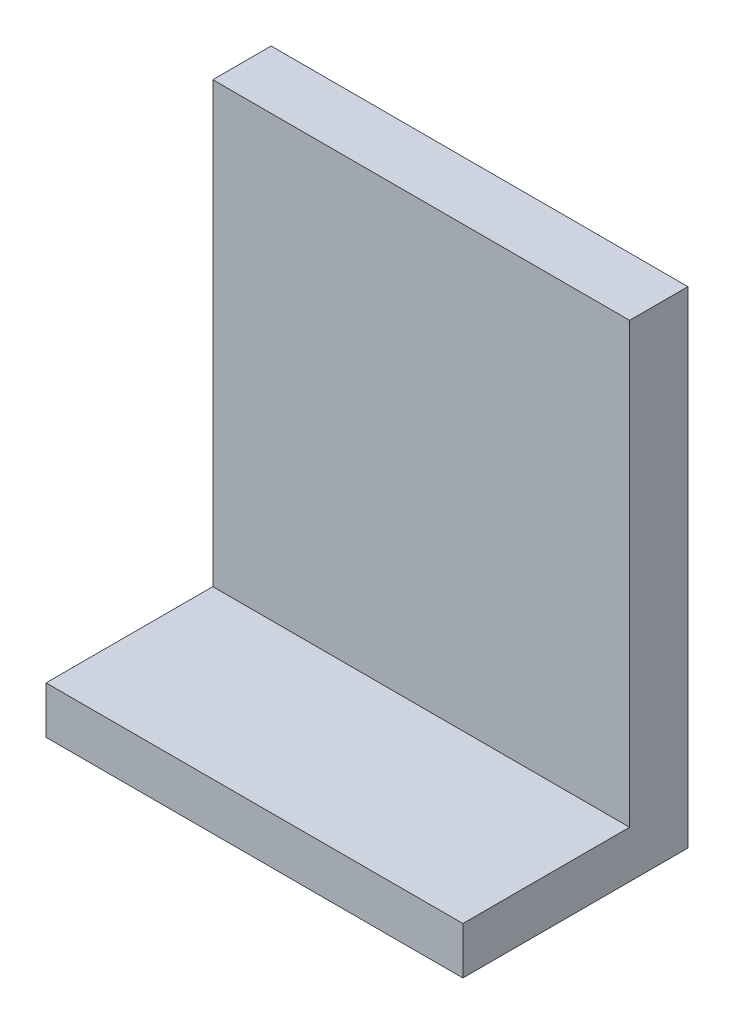
ISO-10303-21;
HEADER;
FILE_DESCRIPTION(('STEP AP214'),'2;1');
FILE_NAME('part.step','',(''),(''),'','','');
FILE_SCHEMA(('AUTOMOTIVE_DESIGN { 1 0 10303 214 1 1 1 1 }'));
ENDSEC;
DATA;
#1=APPLICATION_CONTEXT('core data for automotive mechanical design processes');
#2=APPLICATION_PROTOCOL_DEFINITION('international standard','automotive_design',2000,#1);
#3=PRODUCT_CONTEXT('',#1,'mechanical');
#4=PRODUCT('Part','Part','',(#3));
#5=PRODUCT_RELATED_PRODUCT_CATEGORY('part','',(#4));
#6=PRODUCT_DEFINITION_FORMATION('','',#4);
#7=PRODUCT_DEFINITION_CONTEXT('part definition',#1,'design');
#8=PRODUCT_DEFINITION('design','',#6,#7);
#9=PRODUCT_DEFINITION_SHAPE('','',#8);
#10=(LENGTH_UNIT() NAMED_UNIT(*) SI_UNIT(.MILLI.,.METRE.));
#11=(NAMED_UNIT(*) PLANE_ANGLE_UNIT() SI_UNIT($,.RADIAN.));
#12=(NAMED_UNIT(*) SI_UNIT($,.STERADIAN.) SOLID_ANGLE_UNIT());
#13=UNCERTAINTY_MEASURE_WITH_UNIT(LENGTH_MEASURE(1.E-05),#10,'distance_accuracy_value','');
#14=(GEOMETRIC_REPRESENTATION_CONTEXT(3) GLOBAL_UNCERTAINTY_ASSIGNED_CONTEXT((#13)) GLOBAL_UNIT_ASSIGNED_CONTEXT((#10,
#11,#12)) REPRESENTATION_CONTEXT('',''));
#15=CARTESIAN_POINT('',(0.,0.,0.));
#16=DIRECTION('',(0.,0.,1.));
#17=DIRECTION('',(1.,0.,0.));
#18=AXIS2_PLACEMENT_3D('',#15,#16,#17);
#19=CARTESIAN_POINT('',(0.,0.,7.));
#20=DIRECTION('',(1.,0.,0.));
#21=DIRECTION('',(0.,0.,-1.));
#22=AXIS2_PLACEMENT_3D('',#19,#20,#21);
#23=PLANE('',#22);
#24=DIRECTION('',(0.,-1.,0.));
#25=VECTOR('',#24,1.);
#26=CARTESIAN_POINT('',(0.,0.,0.));
#27=LINE('',#26,#25);
#28=CARTESIAN_POINT('',(0.,0.,0.));
#29=VERTEX_POINT('',#28);
#30=CARTESIAN_POINT('',(0.,-58.3196046128501,0.));
#31=VERTEX_POINT('',#30);
#32=EDGE_CURVE('E92',#29,#31,#27,.T.);
#33=ORIENTED_EDGE('',*,*,#32,.T.);
#34=DIRECTION('',(0.,0.,-1.));
#35=VECTOR('',#34,1.);
#36=CARTESIAN_POINT('',(0.,-58.3196046128501,7.));
#37=LINE('',#36,#35);
#38=CARTESIAN_POINT('',(0.,-58.3196046128501,27.));
#39=VERTEX_POINT('',#38);
#40=EDGE_CURVE('E11',#39,#31,#37,.T.);
#41=ORIENTED_EDGE('',*,*,#40,.F.);
#42=DIRECTION('',(0.,-1.,0.));
#43=VECTOR('',#42,1.);
#44=CARTESIAN_POINT('',(0.,-52.6611613799538,27.));
#45=LINE('',#44,#43);
#46=CARTESIAN_POINT('',(0.,-52.6611613799538,27.));
#47=VERTEX_POINT('',#46);
#48=EDGE_CURVE('E129',#47,#39,#45,.T.);
#49=ORIENTED_EDGE('',*,*,#48,.F.);
#50=DIRECTION('',(0.,0.,-1.));
#51=VECTOR('',#50,1.);
#52=CARTESIAN_POINT('',(0.,-52.6611613799538,27.));
#53=LINE('',#52,#51);
#54=CARTESIAN_POINT('',(0.,-52.6611613799538,7.));
#55=VERTEX_POINT('',#54);
#56=EDGE_CURVE('E101',#47,#55,#53,.T.);
#57=ORIENTED_EDGE('',*,*,#56,.T.);
#58=DIRECTION('',(0.,-1.,0.));
#59=VECTOR('',#58,1.);
#60=CARTESIAN_POINT('',(0.,0.,7.));
#61=LINE('',#60,#59);
#62=CARTESIAN_POINT('',(0.,0.,7.));
#63=VERTEX_POINT('',#62);
#64=EDGE_CURVE('E86',#63,#55,#61,.T.);
#65=ORIENTED_EDGE('',*,*,#64,.F.);
#66=DIRECTION('',(0.,0.,-1.));
#67=VECTOR('',#66,1.);
#68=CARTESIAN_POINT('',(0.,0.,7.));
#69=LINE('',#68,#67);
#70=EDGE_CURVE('E79',#63,#29,#69,.T.);
#71=ORIENTED_EDGE('',*,*,#70,.T.);
#72=EDGE_LOOP('',(#33,#41,#49,#57,#65,#71));
#73=FACE_BOUND('',#72,.T.);
#74=ADVANCED_FACE('F37',(#73),#23,.F.);
#75=CARTESIAN_POINT('',(0.,-58.3196046128501,7.));
#76=DIRECTION('',(0.,1.,0.));
#77=DIRECTION('',(0.,0.,1.));
#78=AXIS2_PLACEMENT_3D('',#75,#76,#77);
#79=PLANE('',#78);
#80=DIRECTION('',(1.,0.,0.));
#81=VECTOR('',#80,1.);
#82=CARTESIAN_POINT('',(0.,-58.3196046128501,0.));
#83=LINE('',#82,#81);
#84=CARTESIAN_POINT('',(50.,-58.3196046128501,0.));
#85=VERTEX_POINT('',#84);
#86=EDGE_CURVE('E96',#31,#85,#83,.T.);
#87=ORIENTED_EDGE('',*,*,#86,.T.);
#88=DIRECTION('',(0.,0.,-1.));
#89=VECTOR('',#88,1.);
#90=CARTESIAN_POINT('',(50.,-58.3196046128501,7.));
#91=LINE('',#90,#89);
#92=CARTESIAN_POINT('',(50.,-58.3196046128501,27.));
#93=VERTEX_POINT('',#92);
#94=EDGE_CURVE('E44',#93,#85,#91,.T.);
#95=ORIENTED_EDGE('',*,*,#94,.F.);
#96=DIRECTION('',(1.,0.,0.));
#97=VECTOR('',#96,1.);
#98=CARTESIAN_POINT('',(0.,-58.3196046128501,27.));
#99=LINE('',#98,#97);
#100=EDGE_CURVE('E121',#39,#93,#99,.T.);
#101=ORIENTED_EDGE('',*,*,#100,.F.);
#102=ORIENTED_EDGE('',*,*,#40,.T.);
#103=EDGE_LOOP('',(#87,#95,#101,#102));
#104=FACE_BOUND('',#103,.T.);
#105=ADVANCED_FACE('F119',(#104),#79,.F.);
#106=CARTESIAN_POINT('',(50.,0.,7.));
#107=DIRECTION('',(-1.,0.,0.));
#108=DIRECTION('',(0.,0.,1.));
#109=AXIS2_PLACEMENT_3D('',#106,#107,#108);
#110=PLANE('',#109);
#111=DIRECTION('',(0.,1.,0.));
#112=VECTOR('',#111,1.);
#113=CARTESIAN_POINT('',(50.,0.,0.));
#114=LINE('',#113,#112);
#115=CARTESIAN_POINT('',(50.,0.,0.));
#116=VERTEX_POINT('',#115);
#117=EDGE_CURVE('E87',#85,#116,#114,.T.);
#118=ORIENTED_EDGE('',*,*,#117,.T.);
#119=DIRECTION('',(0.,0.,-1.));
#120=VECTOR('',#119,1.);
#121=CARTESIAN_POINT('',(50.,0.,7.));
#122=LINE('',#121,#120);
#123=CARTESIAN_POINT('',(50.,0.,7.));
#124=VERTEX_POINT('',#123);
#125=EDGE_CURVE('E82',#124,#116,#122,.T.);
#126=ORIENTED_EDGE('',*,*,#125,.F.);
#127=DIRECTION('',(0.,1.,0.));
#128=VECTOR('',#127,1.);
#129=CARTESIAN_POINT('',(50.,0.,7.));
#130=LINE('',#129,#128);
#131=CARTESIAN_POINT('',(50.,-52.6611613799538,7.));
#132=VERTEX_POINT('',#131);
#133=EDGE_CURVE('E138',#132,#124,#130,.T.);
#134=ORIENTED_EDGE('',*,*,#133,.F.);
#135=DIRECTION('',(0.,0.,-1.));
#136=VECTOR('',#135,1.);
#137=CARTESIAN_POINT('',(50.,-52.6611613799538,27.));
#138=LINE('',#137,#136);
#139=CARTESIAN_POINT('',(50.,-52.6611613799538,27.));
#140=VERTEX_POINT('',#139);
#141=EDGE_CURVE('E97',#140,#132,#138,.T.);
#142=ORIENTED_EDGE('',*,*,#141,.F.);
#143=DIRECTION('',(0.,1.,0.));
#144=VECTOR('',#143,1.);
#145=CARTESIAN_POINT('',(50.,-52.6611613799538,27.));
#146=LINE('',#145,#144);
#147=EDGE_CURVE('E115',#93,#140,#146,.T.);
#148=ORIENTED_EDGE('',*,*,#147,.F.);
#149=ORIENTED_EDGE('',*,*,#94,.T.);
#150=EDGE_LOOP('',(#118,#126,#134,#142,#148,#149));
#151=FACE_BOUND('',#150,.T.);
#152=ADVANCED_FACE('F111',(#151),#110,.F.);
#153=CARTESIAN_POINT('',(0.,0.,7.));
#154=DIRECTION('',(0.,-1.,0.));
#155=DIRECTION('',(0.,0.,-1.));
#156=AXIS2_PLACEMENT_3D('',#153,#154,#155);
#157=PLANE('',#156);
#158=DIRECTION('',(-1.,0.,0.));
#159=VECTOR('',#158,1.);
#160=CARTESIAN_POINT('',(0.,0.,0.));
#161=LINE('',#160,#159);
#162=EDGE_CURVE('E76',#116,#29,#161,.T.);
#163=ORIENTED_EDGE('',*,*,#162,.T.);
#164=ORIENTED_EDGE('',*,*,#70,.F.);
#165=DIRECTION('',(-1.,0.,0.));
#166=VECTOR('',#165,1.);
#167=CARTESIAN_POINT('',(0.,0.,7.));
#168=LINE('',#167,#166);
#169=EDGE_CURVE('E57',#124,#63,#168,.T.);
#170=ORIENTED_EDGE('',*,*,#169,.F.);
#171=ORIENTED_EDGE('',*,*,#125,.T.);
#172=EDGE_LOOP('',(#163,#164,#170,#171));
#173=FACE_BOUND('',#172,.T.);
#174=ADVANCED_FACE('F78',(#173),#157,.F.);
#175=CARTESIAN_POINT('',(0.,0.,7.));
#176=DIRECTION('',(0.,0.,1.));
#177=DIRECTION('',(1.,0.,0.));
#178=AXIS2_PLACEMENT_3D('',#175,#176,#177);
#179=PLANE('',#178);
#180=DIRECTION('',(-1.,0.,0.));
#181=VECTOR('',#180,1.);
#182=CARTESIAN_POINT('',(0.,-52.6611613799538,7.));
#183=LINE('',#182,#181);
#184=EDGE_CURVE('E51',#132,#55,#183,.T.);
#185=ORIENTED_EDGE('',*,*,#184,.F.);
#186=ORIENTED_EDGE('',*,*,#133,.T.);
#187=ORIENTED_EDGE('',*,*,#169,.T.);
#188=ORIENTED_EDGE('',*,*,#64,.T.);
#189=EDGE_LOOP('',(#185,#186,#187,#188));
#190=FACE_BOUND('',#189,.T.);
#191=ADVANCED_FACE('F139',(#190),#179,.T.);
#192=CARTESIAN_POINT('',(0.,0.,0.));
#193=DIRECTION('',(0.,0.,1.));
#194=DIRECTION('',(1.,0.,0.));
#195=AXIS2_PLACEMENT_3D('',#192,#193,#194);
#196=PLANE('',#195);
#197=ORIENTED_EDGE('',*,*,#32,.F.);
#198=ORIENTED_EDGE('',*,*,#162,.F.);
#199=ORIENTED_EDGE('',*,*,#117,.F.);
#200=ORIENTED_EDGE('',*,*,#86,.F.);
#201=EDGE_LOOP('',(#197,#198,#199,#200));
#202=FACE_BOUND('',#201,.T.);
#203=ADVANCED_FACE('F95',(#202),#196,.F.);
#204=CARTESIAN_POINT('',(0.,-52.6611613799538,27.));
#205=DIRECTION('',(0.,-1.,0.));
#206=DIRECTION('',(0.,0.,-1.));
#207=AXIS2_PLACEMENT_3D('',#204,#205,#206);
#208=PLANE('',#207);
#209=ORIENTED_EDGE('',*,*,#184,.T.);
#210=ORIENTED_EDGE('',*,*,#56,.F.);
#211=DIRECTION('',(-1.,0.,0.));
#212=VECTOR('',#211,1.);
#213=CARTESIAN_POINT('',(0.,-52.6611613799538,27.));
#214=LINE('',#213,#212);
#215=EDGE_CURVE('E131',#140,#47,#214,.T.);
#216=ORIENTED_EDGE('',*,*,#215,.F.);
#217=ORIENTED_EDGE('',*,*,#141,.T.);
#218=EDGE_LOOP('',(#209,#210,#216,#217));
#219=FACE_BOUND('',#218,.T.);
#220=ADVANCED_FACE('F142',(#219),#208,.F.);
#221=CARTESIAN_POINT('',(0.,0.,27.));
#222=DIRECTION('',(0.,0.,1.));
#223=DIRECTION('',(1.,0.,0.));
#224=AXIS2_PLACEMENT_3D('',#221,#222,#223);
#225=PLANE('',#224);
#226=ORIENTED_EDGE('',*,*,#48,.T.);
#227=ORIENTED_EDGE('',*,*,#100,.T.);
#228=ORIENTED_EDGE('',*,*,#147,.T.);
#229=ORIENTED_EDGE('',*,*,#215,.T.);
#230=EDGE_LOOP('',(#226,#227,#228,#229));
#231=FACE_BOUND('',#230,.T.);
#232=ADVANCED_FACE('F126',(#231),#225,.T.);
#233=CLOSED_SHELL('',(#74,#105,#152,#174,#191,#203,#220,#232));
#234=MANIFOLD_SOLID_BREP('B2',#233);
#235=ADVANCED_BREP_SHAPE_REPRESENTATION('',(#18,#234),#14);
#236=SHAPE_DEFINITION_REPRESENTATION(#9,#235);
ENDSEC;
END-ISO-10303-21;
